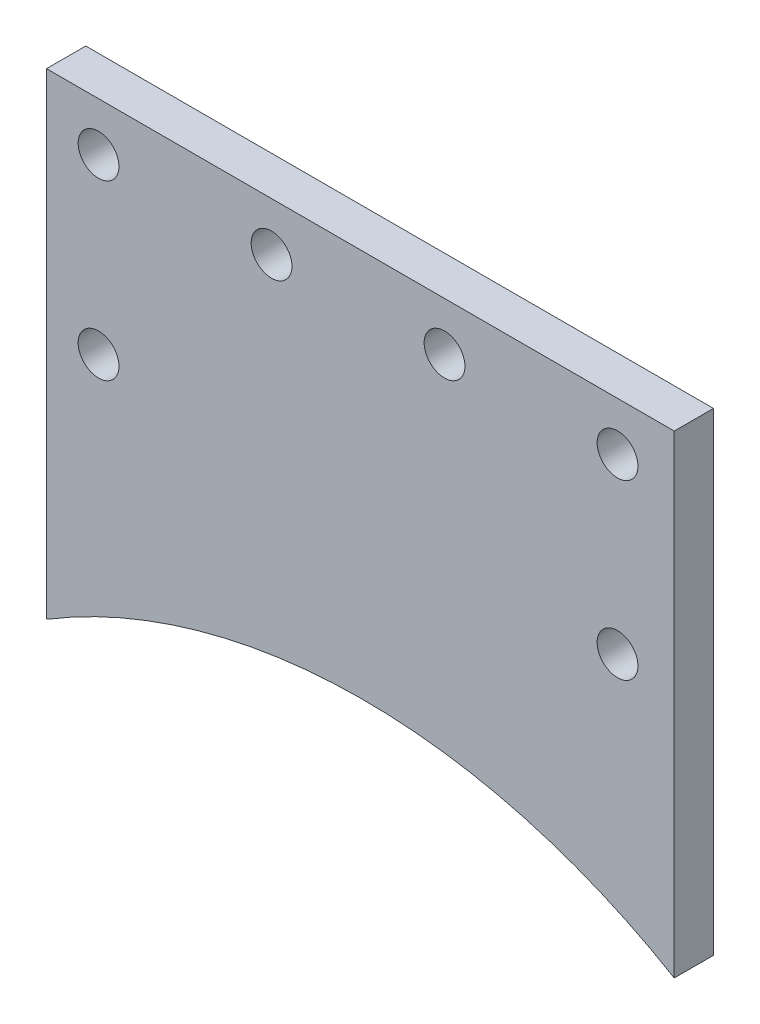
ISO-10303-21;
HEADER;
FILE_DESCRIPTION(('STEP AP214'),'2;1');
FILE_NAME('part.step','',(''),(''),'','','');
FILE_SCHEMA(('AUTOMOTIVE_DESIGN { 1 0 10303 214 1 1 1 1 }'));
ENDSEC;
DATA;
#1=APPLICATION_CONTEXT('core data for automotive mechanical design processes');
#2=APPLICATION_PROTOCOL_DEFINITION('international standard','automotive_design',2000,#1);
#3=PRODUCT_CONTEXT('',#1,'mechanical');
#4=PRODUCT('Part','Part','',(#3));
#5=PRODUCT_RELATED_PRODUCT_CATEGORY('part','',(#4));
#6=PRODUCT_DEFINITION_FORMATION('','',#4);
#7=PRODUCT_DEFINITION_CONTEXT('part definition',#1,'design');
#8=PRODUCT_DEFINITION('design','',#6,#7);
#9=PRODUCT_DEFINITION_SHAPE('','',#8);
#10=(LENGTH_UNIT() NAMED_UNIT(*) SI_UNIT(.MILLI.,.METRE.));
#11=(NAMED_UNIT(*) PLANE_ANGLE_UNIT() SI_UNIT($,.RADIAN.));
#12=(NAMED_UNIT(*) SI_UNIT($,.STERADIAN.) SOLID_ANGLE_UNIT());
#13=UNCERTAINTY_MEASURE_WITH_UNIT(LENGTH_MEASURE(1.E-05),#10,'distance_accuracy_value','');
#14=(GEOMETRIC_REPRESENTATION_CONTEXT(3) GLOBAL_UNCERTAINTY_ASSIGNED_CONTEXT((#13)) GLOBAL_UNIT_ASSIGNED_CONTEXT((#10,
#11,#12)) REPRESENTATION_CONTEXT('',''));
#15=CARTESIAN_POINT('',(0.,0.,0.));
#16=DIRECTION('',(0.,0.,1.));
#17=DIRECTION('',(1.,0.,0.));
#18=AXIS2_PLACEMENT_3D('',#15,#16,#17);
#19=CARTESIAN_POINT('',(-49.7375726226892,7.86010449104424,6.35));
#20=DIRECTION('',(1.,0.,0.));
#21=DIRECTION('',(0.,0.,-1.));
#22=AXIS2_PLACEMENT_3D('',#19,#20,#21);
#23=PLANE('',#22);
#24=DIRECTION('',(0.,-1.,0.));
#25=VECTOR('',#24,1.);
#26=CARTESIAN_POINT('',(-49.7375726226892,7.86010449104424,0.));
#27=LINE('',#26,#25);
#28=CARTESIAN_POINT('',(-49.7375726226892,7.86010449104424,0.));
#29=VERTEX_POINT('',#28);
#30=CARTESIAN_POINT('',(-49.7375726226892,-69.2498955089558,0.));
#31=VERTEX_POINT('',#30);
#32=EDGE_CURVE('E107',#29,#31,#27,.T.);
#33=ORIENTED_EDGE('',*,*,#32,.T.);
#34=DIRECTION('',(0.,0.,-1.));
#35=VECTOR('',#34,1.);
#36=CARTESIAN_POINT('',(-49.7375726226892,-69.2498955089558,6.35));
#37=LINE('',#36,#35);
#38=CARTESIAN_POINT('',(-49.7375726226892,-69.2498955089558,6.35));
#39=VERTEX_POINT('',#38);
#40=EDGE_CURVE('E11',#39,#31,#37,.T.);
#41=ORIENTED_EDGE('',*,*,#40,.F.);
#42=DIRECTION('',(0.,-1.,0.));
#43=VECTOR('',#42,1.);
#44=CARTESIAN_POINT('',(-49.7375726226892,7.86010449104424,6.35));
#45=LINE('',#44,#43);
#46=CARTESIAN_POINT('',(-49.7375726226892,7.86010449104424,6.35));
#47=VERTEX_POINT('',#46);
#48=EDGE_CURVE('E105',#47,#39,#45,.T.);
#49=ORIENTED_EDGE('',*,*,#48,.F.);
#50=DIRECTION('',(0.,0.,-1.));
#51=VECTOR('',#50,1.);
#52=CARTESIAN_POINT('',(-49.7375726226892,7.86010449104424,6.35));
#53=LINE('',#52,#51);
#54=EDGE_CURVE('E111',#47,#29,#53,.T.);
#55=ORIENTED_EDGE('',*,*,#54,.T.);
#56=EDGE_LOOP('',(#33,#41,#49,#55));
#57=FACE_BOUND('',#56,.T.);
#58=ADVANCED_FACE('F32',(#57),#23,.F.);
#59=CARTESIAN_POINT('',(-49.7375726226892,-69.2498955089558,6.35));
#60=DIRECTION('',(0.,1.,0.));
#61=DIRECTION('',(0.,0.,1.));
#62=AXIS2_PLACEMENT_3D('',#59,#60,#61);
#63=PLANE('',#62);
#64=DIRECTION('',(1.,0.,0.));
#65=VECTOR('',#64,1.);
#66=CARTESIAN_POINT('',(-49.7375726226892,-69.2498955089558,0.));
#67=LINE('',#66,#65);
#68=CARTESIAN_POINT('',(-49.6004711131934,-69.2498955089558,0.));
#69=VERTEX_POINT('',#68);
#70=EDGE_CURVE('E103',#31,#69,#67,.T.);
#71=ORIENTED_EDGE('',*,*,#70,.T.);
#72=DIRECTION('',(0.,0.,1.));
#73=VECTOR('',#72,1.);
#74=CARTESIAN_POINT('',(-49.6004711131934,-69.2498955089558,0.));
#75=LINE('',#74,#73);
#76=CARTESIAN_POINT('',(-49.6004711131934,-69.2498955089558,6.35));
#77=VERTEX_POINT('',#76);
#78=EDGE_CURVE('E46',#69,#77,#75,.T.);
#79=ORIENTED_EDGE('',*,*,#78,.T.);
#80=DIRECTION('',(1.,0.,0.));
#81=VECTOR('',#80,1.);
#82=CARTESIAN_POINT('',(-49.7375726226892,-69.2498955089558,6.35));
#83=LINE('',#82,#81);
#84=EDGE_CURVE('E77',#39,#77,#83,.T.);
#85=ORIENTED_EDGE('',*,*,#84,.F.);
#86=ORIENTED_EDGE('',*,*,#40,.T.);
#87=EDGE_LOOP('',(#71,#79,#85,#86));
#88=FACE_BOUND('',#87,.T.);
#89=ADVANCED_FACE('F124',(#88),#63,.F.);
#90=CARTESIAN_POINT('',(51.8624273773108,7.86010449104424,6.35));
#91=DIRECTION('',(-1.,0.,0.));
#92=DIRECTION('',(0.,-1.,0.));
#93=AXIS2_PLACEMENT_3D('',#90,#91,#92);
#94=PLANE('',#93);
#95=DIRECTION('',(0.,1.,0.));
#96=VECTOR('',#95,1.);
#97=CARTESIAN_POINT('',(51.8624273773108,7.86010449104424,6.35));
#98=LINE('',#97,#96);
#99=CARTESIAN_POINT('',(51.8624273773108,-68.8053609560311,6.35));
#100=VERTEX_POINT('',#99);
#101=CARTESIAN_POINT('',(51.8624273773108,7.86010449104424,6.35));
#102=VERTEX_POINT('',#101);
#103=EDGE_CURVE('E99',#100,#102,#98,.T.);
#104=ORIENTED_EDGE('',*,*,#103,.F.);
#105=DIRECTION('',(0.,0.,1.));
#106=VECTOR('',#105,1.);
#107=CARTESIAN_POINT('',(51.8624273773108,-68.8053609560311,0.));
#108=LINE('',#107,#106);
#109=CARTESIAN_POINT('',(51.8624273773108,-68.8053609560311,0.));
#110=VERTEX_POINT('',#109);
#111=EDGE_CURVE('E87',#100,#110,#108,.F.);
#112=ORIENTED_EDGE('',*,*,#111,.T.);
#113=DIRECTION('',(0.,1.,0.));
#114=VECTOR('',#113,1.);
#115=CARTESIAN_POINT('',(51.8624273773108,7.86010449104424,0.));
#116=LINE('',#115,#114);
#117=CARTESIAN_POINT('',(51.8624273773108,7.86010449104424,0.));
#118=VERTEX_POINT('',#117);
#119=EDGE_CURVE('E98',#110,#118,#116,.T.);
#120=ORIENTED_EDGE('',*,*,#119,.T.);
#121=DIRECTION('',(0.,0.,-1.));
#122=VECTOR('',#121,1.);
#123=CARTESIAN_POINT('',(51.8624273773108,7.86010449104424,6.35));
#124=LINE('',#123,#122);
#125=EDGE_CURVE('E39',#102,#118,#124,.T.);
#126=ORIENTED_EDGE('',*,*,#125,.F.);
#127=EDGE_LOOP('',(#104,#112,#120,#126));
#128=FACE_BOUND('',#127,.T.);
#129=ADVANCED_FACE('F96',(#128),#94,.F.);
#130=CARTESIAN_POINT('',(-49.7375726226892,7.86010449104424,6.35));
#131=DIRECTION('',(0.,-1.,0.));
#132=DIRECTION('',(0.,0.,-1.));
#133=AXIS2_PLACEMENT_3D('',#130,#131,#132);
#134=PLANE('',#133);
#135=DIRECTION('',(-1.,0.,0.));
#136=VECTOR('',#135,1.);
#137=CARTESIAN_POINT('',(-49.7375726226892,7.86010449104424,0.));
#138=LINE('',#137,#136);
#139=EDGE_CURVE('E72',#118,#29,#138,.T.);
#140=ORIENTED_EDGE('',*,*,#139,.T.);
#141=ORIENTED_EDGE('',*,*,#54,.F.);
#142=DIRECTION('',(-1.,0.,0.));
#143=VECTOR('',#142,1.);
#144=CARTESIAN_POINT('',(-49.7375726226892,7.86010449104424,6.35));
#145=LINE('',#144,#143);
#146=EDGE_CURVE('E55',#102,#47,#145,.T.);
#147=ORIENTED_EDGE('',*,*,#146,.F.);
#148=ORIENTED_EDGE('',*,*,#125,.T.);
#149=EDGE_LOOP('',(#140,#141,#147,#148));
#150=FACE_BOUND('',#149,.T.);
#151=ADVANCED_FACE('F112',(#150),#134,.F.);
#152=CARTESIAN_POINT('',(-49.7375726226892,-69.2498955089558,6.35));
#153=DIRECTION('',(0.,0.,1.));
#154=DIRECTION('',(1.,0.,0.));
#155=AXIS2_PLACEMENT_3D('',#152,#153,#154);
#156=PLANE('',#155);
#157=CARTESIAN_POINT('',(42.681937749307,-28.,6.35));
#158=DIRECTION('',(0.,0.,1.));
#159=DIRECTION('',(1.,0.,0.));
#160=AXIS2_PLACEMENT_3D('',#157,#158,#159);
#161=CIRCLE('',#160,3.302);
#162=CARTESIAN_POINT('',(45.983937749307,-28.,6.35));
#163=VERTEX_POINT('',#162);
#164=EDGE_CURVE('E173',#163,#163,#161,.T.);
#165=ORIENTED_EDGE('',*,*,#164,.F.);
#166=EDGE_LOOP('',(#165));
#167=FACE_BOUND('',#166,.T.);
#168=CARTESIAN_POINT('',(-41.318062250693,-28.,6.35));
#169=DIRECTION('',(0.,0.,1.));
#170=DIRECTION('',(1.,0.,0.));
#171=AXIS2_PLACEMENT_3D('',#168,#169,#170);
#172=CIRCLE('',#171,3.302);
#173=CARTESIAN_POINT('',(-38.016062250693,-28.,6.35));
#174=VERTEX_POINT('',#173);
#175=EDGE_CURVE('E175',#174,#174,#172,.T.);
#176=ORIENTED_EDGE('',*,*,#175,.F.);
#177=EDGE_LOOP('',(#176));
#178=FACE_BOUND('',#177,.T.);
#179=CARTESIAN_POINT('',(42.681937749307,0.,6.35));
#180=DIRECTION('',(0.,0.,1.));
#181=DIRECTION('',(1.,0.,0.));
#182=AXIS2_PLACEMENT_3D('',#179,#180,#181);
#183=CIRCLE('',#182,3.302);
#184=CARTESIAN_POINT('',(45.983937749307,0.,6.35));
#185=VERTEX_POINT('',#184);
#186=EDGE_CURVE('E181',#185,#185,#183,.T.);
#187=ORIENTED_EDGE('',*,*,#186,.F.);
#188=EDGE_LOOP('',(#187));
#189=FACE_BOUND('',#188,.T.);
#190=CARTESIAN_POINT('',(14.681937749307,0.,6.35));
#191=DIRECTION('',(0.,0.,1.));
#192=DIRECTION('',(1.,0.,0.));
#193=AXIS2_PLACEMENT_3D('',#190,#191,#192);
#194=CIRCLE('',#193,3.302);
#195=CARTESIAN_POINT('',(17.983937749307,0.,6.35));
#196=VERTEX_POINT('',#195);
#197=EDGE_CURVE('E187',#196,#196,#194,.T.);
#198=ORIENTED_EDGE('',*,*,#197,.F.);
#199=EDGE_LOOP('',(#198));
#200=FACE_BOUND('',#199,.T.);
#201=CARTESIAN_POINT('',(-13.318062250693,0.,6.35));
#202=DIRECTION('',(0.,0.,1.));
#203=DIRECTION('',(1.,0.,0.));
#204=AXIS2_PLACEMENT_3D('',#201,#202,#203);
#205=CIRCLE('',#204,3.302);
#206=CARTESIAN_POINT('',(-10.016062250693,0.,6.35));
#207=VERTEX_POINT('',#206);
#208=EDGE_CURVE('E193',#207,#207,#205,.T.);
#209=ORIENTED_EDGE('',*,*,#208,.F.);
#210=EDGE_LOOP('',(#209));
#211=FACE_BOUND('',#210,.T.);
#212=CARTESIAN_POINT('',(-41.318062250693,0.,6.35));
#213=DIRECTION('',(0.,0.,1.));
#214=DIRECTION('',(1.,0.,0.));
#215=AXIS2_PLACEMENT_3D('',#212,#213,#214);
#216=CIRCLE('',#215,3.302);
#217=CARTESIAN_POINT('',(-38.016062250693,0.,6.35));
#218=VERTEX_POINT('',#217);
#219=EDGE_CURVE('E199',#218,#218,#216,.T.);
#220=ORIENTED_EDGE('',*,*,#219,.F.);
#221=EDGE_LOOP('',(#220));
#222=FACE_BOUND('',#221,.T.);
#223=CARTESIAN_POINT('',(1.50114275747182,-153.515944305926,6.35));
#224=DIRECTION('',(0.,0.,1.));
#225=DIRECTION('',(1.,0.,0.));
#226=AXIS2_PLACEMENT_3D('',#223,#224,#225);
#227=CIRCLE('',#226,98.5502);
#228=EDGE_CURVE('E92',#100,#77,#227,.T.);
#229=ORIENTED_EDGE('',*,*,#228,.F.);
#230=ORIENTED_EDGE('',*,*,#103,.T.);
#231=ORIENTED_EDGE('',*,*,#146,.T.);
#232=ORIENTED_EDGE('',*,*,#48,.T.);
#233=ORIENTED_EDGE('',*,*,#84,.T.);
#234=EDGE_LOOP('',(#229,#230,#231,#232,#233));
#235=FACE_BOUND('',#234,.T.);
#236=ADVANCED_FACE('F123',(#167,#178,#189,#200,#211,#222,#235),#156,.T.);
#237=CARTESIAN_POINT('',(-49.7375726226892,-69.2498955089558,0.));
#238=DIRECTION('',(0.,0.,1.));
#239=DIRECTION('',(1.,0.,0.));
#240=AXIS2_PLACEMENT_3D('',#237,#238,#239);
#241=PLANE('',#240);
#242=CARTESIAN_POINT('',(42.681937749307,-28.,0.));
#243=DIRECTION('',(0.,0.,1.));
#244=DIRECTION('',(1.,0.,0.));
#245=AXIS2_PLACEMENT_3D('',#242,#243,#244);
#246=CIRCLE('',#245,3.302);
#247=CARTESIAN_POINT('',(45.983937749307,-28.,0.));
#248=VERTEX_POINT('',#247);
#249=EDGE_CURVE('E170',#248,#248,#246,.T.);
#250=ORIENTED_EDGE('',*,*,#249,.T.);
#251=EDGE_LOOP('',(#250));
#252=FACE_BOUND('',#251,.T.);
#253=CARTESIAN_POINT('',(-41.318062250693,-28.,0.));
#254=DIRECTION('',(0.,0.,1.));
#255=DIRECTION('',(1.,0.,0.));
#256=AXIS2_PLACEMENT_3D('',#253,#254,#255);
#257=CIRCLE('',#256,3.302);
#258=CARTESIAN_POINT('',(-38.016062250693,-28.,0.));
#259=VERTEX_POINT('',#258);
#260=EDGE_CURVE('E178',#259,#259,#257,.T.);
#261=ORIENTED_EDGE('',*,*,#260,.T.);
#262=EDGE_LOOP('',(#261));
#263=FACE_BOUND('',#262,.T.);
#264=CARTESIAN_POINT('',(42.681937749307,0.,0.));
#265=DIRECTION('',(0.,0.,1.));
#266=DIRECTION('',(1.,0.,0.));
#267=AXIS2_PLACEMENT_3D('',#264,#265,#266);
#268=CIRCLE('',#267,3.302);
#269=CARTESIAN_POINT('',(45.983937749307,0.,0.));
#270=VERTEX_POINT('',#269);
#271=EDGE_CURVE('E184',#270,#270,#268,.T.);
#272=ORIENTED_EDGE('',*,*,#271,.T.);
#273=EDGE_LOOP('',(#272));
#274=FACE_BOUND('',#273,.T.);
#275=CARTESIAN_POINT('',(14.681937749307,0.,0.));
#276=DIRECTION('',(0.,0.,1.));
#277=DIRECTION('',(1.,0.,0.));
#278=AXIS2_PLACEMENT_3D('',#275,#276,#277);
#279=CIRCLE('',#278,3.302);
#280=CARTESIAN_POINT('',(17.983937749307,0.,0.));
#281=VERTEX_POINT('',#280);
#282=EDGE_CURVE('E190',#281,#281,#279,.T.);
#283=ORIENTED_EDGE('',*,*,#282,.T.);
#284=EDGE_LOOP('',(#283));
#285=FACE_BOUND('',#284,.T.);
#286=CARTESIAN_POINT('',(-13.318062250693,0.,0.));
#287=DIRECTION('',(0.,0.,1.));
#288=DIRECTION('',(1.,0.,0.));
#289=AXIS2_PLACEMENT_3D('',#286,#287,#288);
#290=CIRCLE('',#289,3.302);
#291=CARTESIAN_POINT('',(-10.016062250693,0.,0.));
#292=VERTEX_POINT('',#291);
#293=EDGE_CURVE('E196',#292,#292,#290,.T.);
#294=ORIENTED_EDGE('',*,*,#293,.T.);
#295=EDGE_LOOP('',(#294));
#296=FACE_BOUND('',#295,.T.);
#297=CARTESIAN_POINT('',(-41.318062250693,0.,0.));
#298=DIRECTION('',(0.,0.,1.));
#299=DIRECTION('',(1.,0.,0.));
#300=AXIS2_PLACEMENT_3D('',#297,#298,#299);
#301=CIRCLE('',#300,3.302);
#302=CARTESIAN_POINT('',(-38.016062250693,0.,0.));
#303=VERTEX_POINT('',#302);
#304=EDGE_CURVE('E202',#303,#303,#301,.T.);
#305=ORIENTED_EDGE('',*,*,#304,.T.);
#306=EDGE_LOOP('',(#305));
#307=FACE_BOUND('',#306,.T.);
#308=ORIENTED_EDGE('',*,*,#119,.F.);
#309=CARTESIAN_POINT('',(1.50114275747182,-153.515944305926,0.));
#310=DIRECTION('',(0.,0.,1.));
#311=DIRECTION('',(1.,0.,0.));
#312=AXIS2_PLACEMENT_3D('',#309,#310,#311);
#313=CIRCLE('',#312,98.5502);
#314=EDGE_CURVE('E84',#110,#69,#313,.T.);
#315=ORIENTED_EDGE('',*,*,#314,.T.);
#316=ORIENTED_EDGE('',*,*,#70,.F.);
#317=ORIENTED_EDGE('',*,*,#32,.F.);
#318=ORIENTED_EDGE('',*,*,#139,.F.);
#319=EDGE_LOOP('',(#308,#315,#316,#317,#318));
#320=FACE_BOUND('',#319,.T.);
#321=ADVANCED_FACE('F101',(#252,#263,#274,#285,#296,#307,#320),#241,.F.);
#322=CARTESIAN_POINT('',(1.50114275747182,-153.515944305926,0.));
#323=DIRECTION('',(0.,0.,1.));
#324=DIRECTION('',(1.,0.,0.));
#325=AXIS2_PLACEMENT_3D('',#322,#323,#324);
#326=CYLINDRICAL_SURFACE('',#325,98.5502);
#327=ORIENTED_EDGE('',*,*,#314,.F.);
#328=ORIENTED_EDGE('',*,*,#111,.F.);
#329=ORIENTED_EDGE('',*,*,#228,.T.);
#330=ORIENTED_EDGE('',*,*,#78,.F.);
#331=EDGE_LOOP('',(#327,#328,#329,#330));
#332=FACE_BOUND('',#331,.T.);
#333=ADVANCED_FACE('F86',(#332),#326,.F.);
#334=CARTESIAN_POINT('',(-41.318062250693,0.,0.));
#335=DIRECTION('',(0.,0.,1.));
#336=DIRECTION('',(1.,0.,0.));
#337=AXIS2_PLACEMENT_3D('',#334,#335,#336);
#338=CYLINDRICAL_SURFACE('',#337,3.302);
#339=ORIENTED_EDGE('',*,*,#304,.F.);
#340=EDGE_LOOP('',(#339));
#341=FACE_BOUND('',#340,.T.);
#342=ORIENTED_EDGE('',*,*,#219,.T.);
#343=EDGE_LOOP('',(#342));
#344=FACE_BOUND('',#343,.T.);
#345=ADVANCED_FACE('F142',(#341,#344),#338,.F.);
#346=CARTESIAN_POINT('',(-13.318062250693,0.,0.));
#347=DIRECTION('',(0.,0.,1.));
#348=DIRECTION('',(1.,0.,0.));
#349=AXIS2_PLACEMENT_3D('',#346,#347,#348);
#350=CYLINDRICAL_SURFACE('',#349,3.302);
#351=ORIENTED_EDGE('',*,*,#293,.F.);
#352=EDGE_LOOP('',(#351));
#353=FACE_BOUND('',#352,.T.);
#354=ORIENTED_EDGE('',*,*,#208,.T.);
#355=EDGE_LOOP('',(#354));
#356=FACE_BOUND('',#355,.T.);
#357=ADVANCED_FACE('F145',(#353,#356),#350,.F.);
#358=CARTESIAN_POINT('',(14.681937749307,0.,0.));
#359=DIRECTION('',(0.,0.,1.));
#360=DIRECTION('',(1.,0.,0.));
#361=AXIS2_PLACEMENT_3D('',#358,#359,#360);
#362=CYLINDRICAL_SURFACE('',#361,3.302);
#363=ORIENTED_EDGE('',*,*,#282,.F.);
#364=EDGE_LOOP('',(#363));
#365=FACE_BOUND('',#364,.T.);
#366=ORIENTED_EDGE('',*,*,#197,.T.);
#367=EDGE_LOOP('',(#366));
#368=FACE_BOUND('',#367,.T.);
#369=ADVANCED_FACE('F149',(#365,#368),#362,.F.);
#370=CARTESIAN_POINT('',(42.681937749307,0.,0.));
#371=DIRECTION('',(0.,0.,1.));
#372=DIRECTION('',(1.,0.,0.));
#373=AXIS2_PLACEMENT_3D('',#370,#371,#372);
#374=CYLINDRICAL_SURFACE('',#373,3.302);
#375=ORIENTED_EDGE('',*,*,#271,.F.);
#376=EDGE_LOOP('',(#375));
#377=FACE_BOUND('',#376,.T.);
#378=ORIENTED_EDGE('',*,*,#186,.T.);
#379=EDGE_LOOP('',(#378));
#380=FACE_BOUND('',#379,.T.);
#381=ADVANCED_FACE('F153',(#377,#380),#374,.F.);
#382=CARTESIAN_POINT('',(-41.318062250693,-28.,0.));
#383=DIRECTION('',(0.,0.,1.));
#384=DIRECTION('',(1.,0.,0.));
#385=AXIS2_PLACEMENT_3D('',#382,#383,#384);
#386=CYLINDRICAL_SURFACE('',#385,3.302);
#387=ORIENTED_EDGE('',*,*,#260,.F.);
#388=EDGE_LOOP('',(#387));
#389=FACE_BOUND('',#388,.T.);
#390=ORIENTED_EDGE('',*,*,#175,.T.);
#391=EDGE_LOOP('',(#390));
#392=FACE_BOUND('',#391,.T.);
#393=ADVANCED_FACE('F157',(#389,#392),#386,.F.);
#394=CARTESIAN_POINT('',(42.681937749307,-28.,0.));
#395=DIRECTION('',(0.,0.,1.));
#396=DIRECTION('',(1.,0.,0.));
#397=AXIS2_PLACEMENT_3D('',#394,#395,#396);
#398=CYLINDRICAL_SURFACE('',#397,3.302);
#399=ORIENTED_EDGE('',*,*,#249,.F.);
#400=EDGE_LOOP('',(#399));
#401=FACE_BOUND('',#400,.T.);
#402=ORIENTED_EDGE('',*,*,#164,.T.);
#403=EDGE_LOOP('',(#402));
#404=FACE_BOUND('',#403,.T.);
#405=ADVANCED_FACE('F161',(#401,#404),#398,.F.);
#406=CLOSED_SHELL('',(#58,#89,#129,#151,#236,#321,#333,#345,#357,#369,#381,#393,#405));
#407=MANIFOLD_SOLID_BREP('B2',#406);
#408=ADVANCED_BREP_SHAPE_REPRESENTATION('',(#18,#407),#14);
#409=SHAPE_DEFINITION_REPRESENTATION(#9,#408);
ENDSEC;
END-ISO-10303-21;
